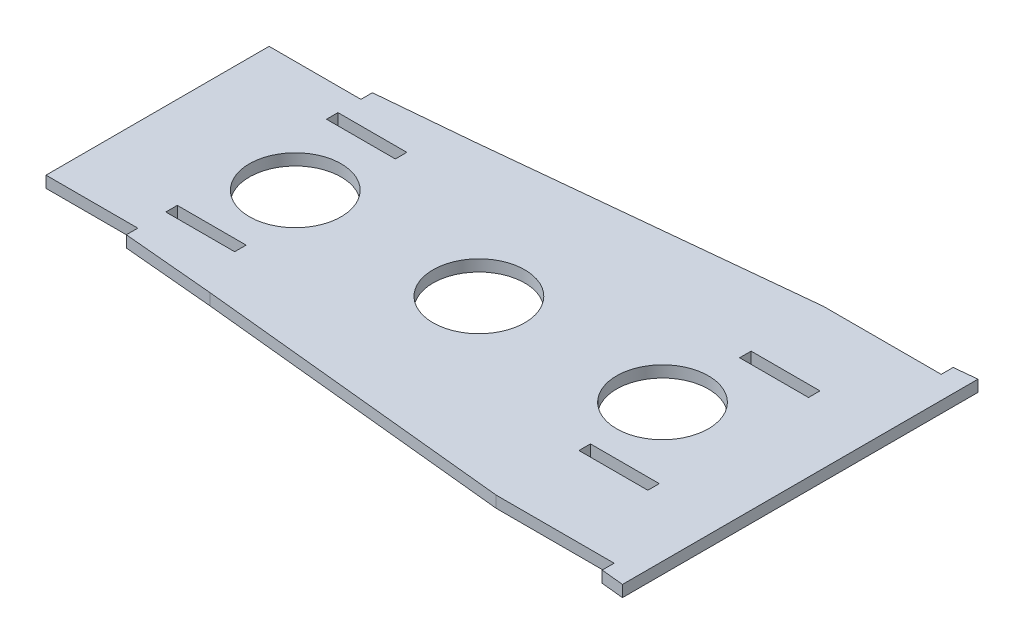
ISO-10303-21;
HEADER;
FILE_DESCRIPTION(('STEP AP214'),'2;1');
FILE_NAME('part.step','',(''),(''),'','','');
FILE_SCHEMA(('AUTOMOTIVE_DESIGN { 1 0 10303 214 1 1 1 1 }'));
ENDSEC;
DATA;
#1=APPLICATION_CONTEXT('core data for automotive mechanical design processes');
#2=APPLICATION_PROTOCOL_DEFINITION('international standard','automotive_design',2000,#1);
#3=PRODUCT_CONTEXT('',#1,'mechanical');
#4=PRODUCT('Part','Part','',(#3));
#5=PRODUCT_RELATED_PRODUCT_CATEGORY('part','',(#4));
#6=PRODUCT_DEFINITION_FORMATION('','',#4);
#7=PRODUCT_DEFINITION_CONTEXT('part definition',#1,'design');
#8=PRODUCT_DEFINITION('design','',#6,#7);
#9=PRODUCT_DEFINITION_SHAPE('','',#8);
#10=(LENGTH_UNIT() NAMED_UNIT(*) SI_UNIT(.MILLI.,.METRE.));
#11=(NAMED_UNIT(*) PLANE_ANGLE_UNIT() SI_UNIT($,.RADIAN.));
#12=(NAMED_UNIT(*) SI_UNIT($,.STERADIAN.) SOLID_ANGLE_UNIT());
#13=UNCERTAINTY_MEASURE_WITH_UNIT(LENGTH_MEASURE(1.E-05),#10,'distance_accuracy_value','');
#14=(GEOMETRIC_REPRESENTATION_CONTEXT(3) GLOBAL_UNCERTAINTY_ASSIGNED_CONTEXT((#13)) GLOBAL_UNIT_ASSIGNED_CONTEXT((#10,
#11,#12)) REPRESENTATION_CONTEXT('',''));
#15=CARTESIAN_POINT('',(0.,0.,0.));
#16=DIRECTION('',(0.,0.,1.));
#17=DIRECTION('',(1.,0.,0.));
#18=AXIS2_PLACEMENT_3D('',#15,#16,#17);
#19=CARTESIAN_POINT('',(25.4,-19.3127710336968,23.1142030780968));
#20=DIRECTION('',(0.,0.,1.));
#21=DIRECTION('',(1.,0.,0.));
#22=AXIS2_PLACEMENT_3D('',#19,#20,#21);
#23=PLANE('',#22);
#24=DIRECTION('',(-1.,0.,0.));
#25=VECTOR('',#24,1.);
#26=CARTESIAN_POINT('',(25.4,0.,23.1142030780968));
#27=LINE('',#26,#25);
#28=CARTESIAN_POINT('',(44.45,0.,23.1142030780968));
#29=VERTEX_POINT('',#28);
#30=CARTESIAN_POINT('',(25.4,0.,23.1142030780968));
#31=VERTEX_POINT('',#30);
#32=EDGE_CURVE('E473',#29,#31,#27,.T.);
#33=ORIENTED_EDGE('',*,*,#32,.T.);
#34=DIRECTION('',(0.,1.,0.));
#35=VECTOR('',#34,1.);
#36=CARTESIAN_POINT('',(25.4,-19.3127710336968,23.1142030780968));
#37=LINE('',#36,#35);
#38=CARTESIAN_POINT('',(25.4,3.175,23.1142030780968));
#39=VERTEX_POINT('',#38);
#40=EDGE_CURVE('E491',#31,#39,#37,.T.);
#41=ORIENTED_EDGE('',*,*,#40,.T.);
#42=DIRECTION('',(1.,0.,0.));
#43=VECTOR('',#42,1.);
#44=CARTESIAN_POINT('',(25.4,3.175,23.1142030780968));
#45=LINE('',#44,#43);
#46=CARTESIAN_POINT('',(44.45,3.175,23.1142030780968));
#47=VERTEX_POINT('',#46);
#48=EDGE_CURVE('E487',#39,#47,#45,.T.);
#49=ORIENTED_EDGE('',*,*,#48,.T.);
#50=DIRECTION('',(0.,1.,0.));
#51=VECTOR('',#50,1.);
#52=CARTESIAN_POINT('',(44.45,-19.3127710336968,23.1142030780968));
#53=LINE('',#52,#51);
#54=EDGE_CURVE('E11',#29,#47,#53,.T.);
#55=ORIENTED_EDGE('',*,*,#54,.F.);
#56=EDGE_LOOP('',(#33,#41,#49,#55));
#57=FACE_BOUND('',#56,.T.);
#58=ADVANCED_FACE('F49',(#57),#23,.F.);
#59=CARTESIAN_POINT('',(44.45,-19.3127710336968,19.9392030780968));
#60=DIRECTION('',(1.,0.,0.));
#61=DIRECTION('',(0.,0.,-1.));
#62=AXIS2_PLACEMENT_3D('',#59,#60,#61);
#63=PLANE('',#62);
#64=DIRECTION('',(0.,0.,1.));
#65=VECTOR('',#64,1.);
#66=CARTESIAN_POINT('',(44.45,0.,19.9392030780968));
#67=LINE('',#66,#65);
#68=CARTESIAN_POINT('',(44.45,0.,19.9392030780968));
#69=VERTEX_POINT('',#68);
#70=EDGE_CURVE('E476',#69,#29,#67,.T.);
#71=ORIENTED_EDGE('',*,*,#70,.T.);
#72=ORIENTED_EDGE('',*,*,#54,.T.);
#73=DIRECTION('',(0.,0.,-1.));
#74=VECTOR('',#73,1.);
#75=CARTESIAN_POINT('',(44.45,3.175,19.9392030780968));
#76=LINE('',#75,#74);
#77=CARTESIAN_POINT('',(44.45,3.175,19.9392030780968));
#78=VERTEX_POINT('',#77);
#79=EDGE_CURVE('E70',#47,#78,#76,.T.);
#80=ORIENTED_EDGE('',*,*,#79,.T.);
#81=DIRECTION('',(0.,1.,0.));
#82=VECTOR('',#81,1.);
#83=CARTESIAN_POINT('',(44.45,-19.3127710336968,19.9392030780968));
#84=LINE('',#83,#82);
#85=EDGE_CURVE('E56',#69,#78,#84,.T.);
#86=ORIENTED_EDGE('',*,*,#85,.F.);
#87=EDGE_LOOP('',(#71,#72,#80,#86));
#88=FACE_BOUND('',#87,.T.);
#89=ADVANCED_FACE('F500',(#88),#63,.F.);
#90=CARTESIAN_POINT('',(25.4,-19.3127710336968,19.9392030780968));
#91=DIRECTION('',(0.,0.,-1.));
#92=DIRECTION('',(-1.,0.,0.));
#93=AXIS2_PLACEMENT_3D('',#90,#91,#92);
#94=PLANE('',#93);
#95=DIRECTION('',(1.,0.,0.));
#96=VECTOR('',#95,1.);
#97=CARTESIAN_POINT('',(25.4,0.,19.9392030780968));
#98=LINE('',#97,#96);
#99=CARTESIAN_POINT('',(25.4,0.,19.9392030780968));
#100=VERTEX_POINT('',#99);
#101=EDGE_CURVE('E479',#100,#69,#98,.T.);
#102=ORIENTED_EDGE('',*,*,#101,.T.);
#103=ORIENTED_EDGE('',*,*,#85,.T.);
#104=DIRECTION('',(-1.,0.,0.));
#105=VECTOR('',#104,1.);
#106=CARTESIAN_POINT('',(25.4,3.175,19.9392030780968));
#107=LINE('',#106,#105);
#108=CARTESIAN_POINT('',(25.4,3.175,19.9392030780968));
#109=VERTEX_POINT('',#108);
#110=EDGE_CURVE('E483',#78,#109,#107,.T.);
#111=ORIENTED_EDGE('',*,*,#110,.T.);
#112=DIRECTION('',(0.,1.,0.));
#113=VECTOR('',#112,1.);
#114=CARTESIAN_POINT('',(25.4,-19.3127710336968,19.9392030780968));
#115=LINE('',#114,#113);
#116=EDGE_CURVE('E489',#100,#109,#115,.T.);
#117=ORIENTED_EDGE('',*,*,#116,.F.);
#118=EDGE_LOOP('',(#102,#103,#111,#117));
#119=FACE_BOUND('',#118,.T.);
#120=ADVANCED_FACE('F496',(#119),#94,.F.);
#121=CARTESIAN_POINT('',(25.4,-19.3127710336968,19.9392030780968));
#122=DIRECTION('',(-1.,0.,0.));
#123=DIRECTION('',(0.,0.,1.));
#124=AXIS2_PLACEMENT_3D('',#121,#122,#123);
#125=PLANE('',#124);
#126=DIRECTION('',(0.,0.,-1.));
#127=VECTOR('',#126,1.);
#128=CARTESIAN_POINT('',(25.4,0.,19.9392030780968));
#129=LINE('',#128,#127);
#130=EDGE_CURVE('E471',#31,#100,#129,.T.);
#131=ORIENTED_EDGE('',*,*,#130,.T.);
#132=ORIENTED_EDGE('',*,*,#116,.T.);
#133=DIRECTION('',(0.,0.,1.));
#134=VECTOR('',#133,1.);
#135=CARTESIAN_POINT('',(25.4,3.175,19.9392030780968));
#136=LINE('',#135,#134);
#137=EDGE_CURVE('E63',#109,#39,#136,.T.);
#138=ORIENTED_EDGE('',*,*,#137,.T.);
#139=ORIENTED_EDGE('',*,*,#40,.F.);
#140=EDGE_LOOP('',(#131,#132,#138,#139));
#141=FACE_BOUND('',#140,.T.);
#142=ADVANCED_FACE('F530',(#141),#125,.F.);
#143=CARTESIAN_POINT('',(-88.9,-19.3127710336968,23.1142030780968));
#144=DIRECTION('',(0.,0.,1.));
#145=DIRECTION('',(1.,0.,0.));
#146=AXIS2_PLACEMENT_3D('',#143,#144,#145);
#147=PLANE('',#146);
#148=DIRECTION('',(-1.,0.,0.));
#149=VECTOR('',#148,1.);
#150=CARTESIAN_POINT('',(-88.9,0.,23.1142030780968));
#151=LINE('',#150,#149);
#152=CARTESIAN_POINT('',(-69.85,0.,23.1142030780968));
#153=VERTEX_POINT('',#152);
#154=CARTESIAN_POINT('',(-88.9,0.,23.1142030780968));
#155=VERTEX_POINT('',#154);
#156=EDGE_CURVE('E439',#153,#155,#151,.T.);
#157=ORIENTED_EDGE('',*,*,#156,.T.);
#158=DIRECTION('',(0.,1.,0.));
#159=VECTOR('',#158,1.);
#160=CARTESIAN_POINT('',(-88.9,-19.3127710336968,23.1142030780968));
#161=LINE('',#160,#159);
#162=CARTESIAN_POINT('',(-88.9,3.175,23.1142030780968));
#163=VERTEX_POINT('',#162);
#164=EDGE_CURVE('E462',#155,#163,#161,.T.);
#165=ORIENTED_EDGE('',*,*,#164,.T.);
#166=DIRECTION('',(1.,0.,0.));
#167=VECTOR('',#166,1.);
#168=CARTESIAN_POINT('',(-88.9,3.175,23.1142030780968));
#169=LINE('',#168,#167);
#170=CARTESIAN_POINT('',(-69.85,3.175,23.1142030780968));
#171=VERTEX_POINT('',#170);
#172=EDGE_CURVE('E456',#163,#171,#169,.T.);
#173=ORIENTED_EDGE('',*,*,#172,.T.);
#174=DIRECTION('',(0.,1.,0.));
#175=VECTOR('',#174,1.);
#176=CARTESIAN_POINT('',(-69.85,-19.3127710336968,23.1142030780968));
#177=LINE('',#176,#175);
#178=EDGE_CURVE('E468',#153,#171,#177,.T.);
#179=ORIENTED_EDGE('',*,*,#178,.F.);
#180=EDGE_LOOP('',(#157,#165,#173,#179));
#181=FACE_BOUND('',#180,.T.);
#182=ADVANCED_FACE('F535',(#181),#147,.F.);
#183=CARTESIAN_POINT('',(-69.85,-19.3127710336968,19.9392030780968));
#184=DIRECTION('',(1.,0.,0.));
#185=DIRECTION('',(0.,0.,-1.));
#186=AXIS2_PLACEMENT_3D('',#183,#184,#185);
#187=PLANE('',#186);
#188=DIRECTION('',(0.,0.,1.));
#189=VECTOR('',#188,1.);
#190=CARTESIAN_POINT('',(-69.85,0.,19.9392030780968));
#191=LINE('',#190,#189);
#192=CARTESIAN_POINT('',(-69.85,0.,19.9392030780968));
#193=VERTEX_POINT('',#192);
#194=EDGE_CURVE('E442',#193,#153,#191,.T.);
#195=ORIENTED_EDGE('',*,*,#194,.T.);
#196=ORIENTED_EDGE('',*,*,#178,.T.);
#197=DIRECTION('',(0.,0.,-1.));
#198=VECTOR('',#197,1.);
#199=CARTESIAN_POINT('',(-69.85,3.175,19.9392030780968));
#200=LINE('',#199,#198);
#201=CARTESIAN_POINT('',(-69.85,3.175,19.9392030780968));
#202=VERTEX_POINT('',#201);
#203=EDGE_CURVE('E453',#171,#202,#200,.T.);
#204=ORIENTED_EDGE('',*,*,#203,.T.);
#205=DIRECTION('',(0.,1.,0.));
#206=VECTOR('',#205,1.);
#207=CARTESIAN_POINT('',(-69.85,-19.3127710336968,19.9392030780968));
#208=LINE('',#207,#206);
#209=EDGE_CURVE('E465',#193,#202,#208,.T.);
#210=ORIENTED_EDGE('',*,*,#209,.F.);
#211=EDGE_LOOP('',(#195,#196,#204,#210));
#212=FACE_BOUND('',#211,.T.);
#213=ADVANCED_FACE('F538',(#212),#187,.F.);
#214=CARTESIAN_POINT('',(-88.9,-19.3127710336968,19.9392030780968));
#215=DIRECTION('',(0.,0.,-1.));
#216=DIRECTION('',(-1.,0.,0.));
#217=AXIS2_PLACEMENT_3D('',#214,#215,#216);
#218=PLANE('',#217);
#219=DIRECTION('',(1.,0.,0.));
#220=VECTOR('',#219,1.);
#221=CARTESIAN_POINT('',(-88.9,0.,19.9392030780968));
#222=LINE('',#221,#220);
#223=CARTESIAN_POINT('',(-88.9,0.,19.9392030780968));
#224=VERTEX_POINT('',#223);
#225=EDGE_CURVE('E445',#224,#193,#222,.T.);
#226=ORIENTED_EDGE('',*,*,#225,.T.);
#227=ORIENTED_EDGE('',*,*,#209,.T.);
#228=DIRECTION('',(-1.,0.,0.));
#229=VECTOR('',#228,1.);
#230=CARTESIAN_POINT('',(-88.9,3.175,19.9392030780968));
#231=LINE('',#230,#229);
#232=CARTESIAN_POINT('',(-88.9,3.175,19.9392030780968));
#233=VERTEX_POINT('',#232);
#234=EDGE_CURVE('E450',#202,#233,#231,.T.);
#235=ORIENTED_EDGE('',*,*,#234,.T.);
#236=DIRECTION('',(0.,1.,0.));
#237=VECTOR('',#236,1.);
#238=CARTESIAN_POINT('',(-88.9,-19.3127710336968,19.9392030780968));
#239=LINE('',#238,#237);
#240=EDGE_CURVE('E459',#224,#233,#239,.T.);
#241=ORIENTED_EDGE('',*,*,#240,.F.);
#242=EDGE_LOOP('',(#226,#227,#235,#241));
#243=FACE_BOUND('',#242,.T.);
#244=ADVANCED_FACE('F542',(#243),#218,.F.);
#245=CARTESIAN_POINT('',(-88.9,-19.3127710336968,19.9392030780968));
#246=DIRECTION('',(-1.,0.,0.));
#247=DIRECTION('',(0.,0.,1.));
#248=AXIS2_PLACEMENT_3D('',#245,#246,#247);
#249=PLANE('',#248);
#250=DIRECTION('',(0.,0.,-1.));
#251=VECTOR('',#250,1.);
#252=CARTESIAN_POINT('',(-88.9,0.,19.9392030780968));
#253=LINE('',#252,#251);
#254=EDGE_CURVE('E437',#155,#224,#253,.T.);
#255=ORIENTED_EDGE('',*,*,#254,.T.);
#256=ORIENTED_EDGE('',*,*,#240,.T.);
#257=DIRECTION('',(0.,0.,1.));
#258=VECTOR('',#257,1.);
#259=CARTESIAN_POINT('',(-88.9,3.175,19.9392030780968));
#260=LINE('',#259,#258);
#261=EDGE_CURVE('E448',#233,#163,#260,.T.);
#262=ORIENTED_EDGE('',*,*,#261,.T.);
#263=ORIENTED_EDGE('',*,*,#164,.F.);
#264=EDGE_LOOP('',(#255,#256,#262,#263));
#265=FACE_BOUND('',#264,.T.);
#266=ADVANCED_FACE('F546',(#265),#249,.F.);
#267=CARTESIAN_POINT('',(0.,3.175,30.8607969219032));
#268=DIRECTION('',(0.,0.,-1.));
#269=DIRECTION('',(-1.,0.,0.));
#270=AXIS2_PLACEMENT_3D('',#267,#268,#269);
#271=PLANE('',#270);
#272=DIRECTION('',(1.,0.,0.));
#273=VECTOR('',#272,1.);
#274=CARTESIAN_POINT('',(0.,0.,30.8607969219032));
#275=LINE('',#274,#273);
#276=CARTESIAN_POINT('',(-114.3,0.,30.8607969219032));
#277=VERTEX_POINT('',#276);
#278=CARTESIAN_POINT('',(-88.9,0.,30.8607969219032));
#279=VERTEX_POINT('',#278);
#280=EDGE_CURVE('E321',#277,#279,#275,.T.);
#281=ORIENTED_EDGE('',*,*,#280,.T.);
#282=DIRECTION('',(0.,-1.,0.));
#283=VECTOR('',#282,1.);
#284=CARTESIAN_POINT('',(-88.9,3.175,30.8607969219032));
#285=LINE('',#284,#283);
#286=CARTESIAN_POINT('',(-88.9,3.175,30.8607969219032));
#287=VERTEX_POINT('',#286);
#288=EDGE_CURVE('E434',#287,#279,#285,.T.);
#289=ORIENTED_EDGE('',*,*,#288,.F.);
#290=DIRECTION('',(1.,0.,0.));
#291=VECTOR('',#290,1.);
#292=CARTESIAN_POINT('',(0.,3.175,30.8607969219032));
#293=LINE('',#292,#291);
#294=CARTESIAN_POINT('',(-114.3,3.175,30.8607969219032));
#295=VERTEX_POINT('',#294);
#296=EDGE_CURVE('E322',#295,#287,#293,.T.);
#297=ORIENTED_EDGE('',*,*,#296,.F.);
#298=DIRECTION('',(0.,-1.,0.));
#299=VECTOR('',#298,1.);
#300=CARTESIAN_POINT('',(-114.3,3.175,30.8607969219032));
#301=LINE('',#300,#299);
#302=EDGE_CURVE('E361',#295,#277,#301,.T.);
#303=ORIENTED_EDGE('',*,*,#302,.T.);
#304=EDGE_LOOP('',(#281,#289,#297,#303));
#305=FACE_BOUND('',#304,.T.);
#306=ADVANCED_FACE('F550',(#305),#271,.F.);
#307=CARTESIAN_POINT('',(-88.9,3.175,0.));
#308=DIRECTION('',(1.,0.,0.));
#309=DIRECTION('',(0.,0.,-1.));
#310=AXIS2_PLACEMENT_3D('',#307,#308,#309);
#311=PLANE('',#310);
#312=DIRECTION('',(0.,0.,1.));
#313=VECTOR('',#312,1.);
#314=CARTESIAN_POINT('',(-88.9,0.,0.));
#315=LINE('',#314,#313);
#316=CARTESIAN_POINT('',(-88.9,0.,34.0357969219032));
#317=VERTEX_POINT('',#316);
#318=EDGE_CURVE('E364',#279,#317,#315,.T.);
#319=ORIENTED_EDGE('',*,*,#318,.T.);
#320=DIRECTION('',(0.,-1.,0.));
#321=VECTOR('',#320,1.);
#322=CARTESIAN_POINT('',(-88.9,3.175,34.0357969219032));
#323=LINE('',#322,#321);
#324=CARTESIAN_POINT('',(-88.9,3.175,34.0357969219032));
#325=VERTEX_POINT('',#324);
#326=EDGE_CURVE('E431',#325,#317,#323,.T.);
#327=ORIENTED_EDGE('',*,*,#326,.F.);
#328=DIRECTION('',(0.,0.,1.));
#329=VECTOR('',#328,1.);
#330=CARTESIAN_POINT('',(-88.9,3.175,0.));
#331=LINE('',#330,#329);
#332=EDGE_CURVE('E325',#287,#325,#331,.T.);
#333=ORIENTED_EDGE('',*,*,#332,.F.);
#334=ORIENTED_EDGE('',*,*,#288,.T.);
#335=EDGE_LOOP('',(#319,#327,#333,#334));
#336=FACE_BOUND('',#335,.T.);
#337=ADVANCED_FACE('F554',(#336),#311,.F.);
#338=CARTESIAN_POINT('',(-3.75252164128227,3.175,41.6983892030127));
#339=DIRECTION('',(0.0896298004541128,0.,-0.995975149725411));
#340=DIRECTION('',(-0.995975149725412,0.,-0.0896298004541128));
#341=AXIS2_PLACEMENT_3D('',#338,#339,#340);
#342=PLANE('',#341);
#343=DIRECTION('',(0.995975149725412,0.,0.0896298004541128));
#344=VECTOR('',#343,1.);
#345=CARTESIAN_POINT('',(-3.75252164128227,0.,41.6983892030127));
#346=LINE('',#345,#344);
#347=CARTESIAN_POINT('',(-63.5,0.,36.3215938438065));
#348=VERTEX_POINT('',#347);
#349=EDGE_CURVE('E366',#317,#348,#346,.T.);
#350=ORIENTED_EDGE('',*,*,#349,.T.);
#351=DIRECTION('',(0.,-1.,0.));
#352=VECTOR('',#351,1.);
#353=CARTESIAN_POINT('',(-63.5,3.175,36.3215938438065));
#354=LINE('',#353,#352);
#355=CARTESIAN_POINT('',(-63.5,3.175,36.3215938438065));
#356=VERTEX_POINT('',#355);
#357=EDGE_CURVE('E428',#356,#348,#354,.T.);
#358=ORIENTED_EDGE('',*,*,#357,.F.);
#359=DIRECTION('',(0.995975149725412,0.,0.0896298004541128));
#360=VECTOR('',#359,1.);
#361=CARTESIAN_POINT('',(-3.75252164128227,3.175,41.6983892030127));
#362=LINE('',#361,#360);
#363=EDGE_CURVE('E328',#325,#356,#362,.T.);
#364=ORIENTED_EDGE('',*,*,#363,.F.);
#365=ORIENTED_EDGE('',*,*,#326,.T.);
#366=EDGE_LOOP('',(#350,#358,#364,#365));
#367=FACE_BOUND('',#366,.T.);
#368=ADVANCED_FACE('F558',(#367),#342,.F.);
#369=CARTESIAN_POINT('',(-4.28476457205807,3.175,42.3173258059613));
#370=DIRECTION('',(0.100738120693932,0.,-0.994912976616073));
#371=DIRECTION('',(-0.994912976616073,0.,-0.100738120693932));
#372=AXIS2_PLACEMENT_3D('',#369,#370,#371);
#373=PLANE('',#372);
#374=DIRECTION('',(0.994912976616073,0.,0.100738120693932));
#375=VECTOR('',#374,1.);
#376=CARTESIAN_POINT('',(-4.28476457205807,0.,42.3173258059613));
#377=LINE('',#376,#375);
#378=CARTESIAN_POINT('',(24.6454443556202,0.,45.246601981019));
#379=VERTEX_POINT('',#378);
#380=EDGE_CURVE('E368',#348,#379,#377,.T.);
#381=ORIENTED_EDGE('',*,*,#380,.T.);
#382=DIRECTION('',(0.,-1.,0.));
#383=VECTOR('',#382,1.);
#384=CARTESIAN_POINT('',(24.6454443556202,3.175,45.246601981019));
#385=LINE('',#384,#383);
#386=CARTESIAN_POINT('',(24.6454443556202,3.175,45.246601981019));
#387=VERTEX_POINT('',#386);
#388=EDGE_CURVE('E425',#387,#379,#385,.T.);
#389=ORIENTED_EDGE('',*,*,#388,.F.);
#390=DIRECTION('',(0.994912976616073,0.,0.100738120693932));
#391=VECTOR('',#390,1.);
#392=CARTESIAN_POINT('',(-4.28476457205807,3.175,42.3173258059613));
#393=LINE('',#392,#391);
#394=EDGE_CURVE('E330',#356,#387,#393,.T.);
#395=ORIENTED_EDGE('',*,*,#394,.F.);
#396=ORIENTED_EDGE('',*,*,#357,.T.);
#397=EDGE_LOOP('',(#381,#389,#395,#396));
#398=FACE_BOUND('',#397,.T.);
#399=ADVANCED_FACE('F562',(#398),#373,.F.);
#400=CARTESIAN_POINT('',(0.,3.175,45.246601981019));
#401=DIRECTION('',(0.,0.,-1.));
#402=DIRECTION('',(-1.,0.,0.));
#403=AXIS2_PLACEMENT_3D('',#400,#401,#402);
#404=PLANE('',#403);
#405=DIRECTION('',(1.,0.,0.));
#406=VECTOR('',#405,1.);
#407=CARTESIAN_POINT('',(0.,0.,45.246601981019));
#408=LINE('',#407,#406);
#409=CARTESIAN_POINT('',(57.2567599743374,0.,45.246601981019));
#410=VERTEX_POINT('',#409);
#411=EDGE_CURVE('E370',#379,#410,#408,.T.);
#412=ORIENTED_EDGE('',*,*,#411,.T.);
#413=DIRECTION('',(0.,-1.,0.));
#414=VECTOR('',#413,1.);
#415=CARTESIAN_POINT('',(57.2567599743374,3.175,45.246601981019));
#416=LINE('',#415,#414);
#417=CARTESIAN_POINT('',(57.2567599743374,3.175,45.246601981019));
#418=VERTEX_POINT('',#417);
#419=EDGE_CURVE('E422',#418,#410,#416,.T.);
#420=ORIENTED_EDGE('',*,*,#419,.F.);
#421=DIRECTION('',(1.,0.,0.));
#422=VECTOR('',#421,1.);
#423=CARTESIAN_POINT('',(0.,3.175,45.246601981019));
#424=LINE('',#423,#422);
#425=EDGE_CURVE('E332',#387,#418,#424,.T.);
#426=ORIENTED_EDGE('',*,*,#425,.F.);
#427=ORIENTED_EDGE('',*,*,#388,.T.);
#428=EDGE_LOOP('',(#412,#420,#426,#427));
#429=FACE_BOUND('',#428,.T.);
#430=ADVANCED_FACE('F564',(#429),#404,.F.);
#431=CARTESIAN_POINT('',(57.2567599743374,3.175,0.));
#432=DIRECTION('',(1.,0.,0.));
#433=DIRECTION('',(0.,0.,-1.));
#434=AXIS2_PLACEMENT_3D('',#431,#432,#433);
#435=PLANE('',#434);
#436=DIRECTION('',(0.,0.,1.));
#437=VECTOR('',#436,1.);
#438=CARTESIAN_POINT('',(57.2567599743374,0.,0.));
#439=LINE('',#438,#437);
#440=CARTESIAN_POINT('',(57.2567599743374,0.,48.548601981019));
#441=VERTEX_POINT('',#440);
#442=EDGE_CURVE('E373',#410,#441,#439,.T.);
#443=ORIENTED_EDGE('',*,*,#442,.T.);
#444=DIRECTION('',(0.,-1.,0.));
#445=VECTOR('',#444,1.);
#446=CARTESIAN_POINT('',(57.2567599743374,3.175,48.548601981019));
#447=LINE('',#446,#445);
#448=CARTESIAN_POINT('',(57.2567599743374,3.175,48.548601981019));
#449=VERTEX_POINT('',#448);
#450=EDGE_CURVE('E419',#449,#441,#447,.T.);
#451=ORIENTED_EDGE('',*,*,#450,.F.);
#452=DIRECTION('',(0.,0.,1.));
#453=VECTOR('',#452,1.);
#454=CARTESIAN_POINT('',(57.2567599743374,3.175,0.));
#455=LINE('',#454,#453);
#456=EDGE_CURVE('E335',#418,#449,#455,.T.);
#457=ORIENTED_EDGE('',*,*,#456,.F.);
#458=ORIENTED_EDGE('',*,*,#419,.T.);
#459=EDGE_LOOP('',(#443,#451,#457,#458));
#460=FACE_BOUND('',#459,.T.);
#461=ADVANCED_FACE('F567',(#460),#435,.F.);
#462=CARTESIAN_POINT('',(63.5,0.,49.18075));
#463=VERTEX_POINT('',#462);
#464=EDGE_CURVE('E371',#441,#463,#377,.T.);
#465=ORIENTED_EDGE('',*,*,#464,.T.);
#466=DIRECTION('',(0.,-1.,0.));
#467=VECTOR('',#466,1.);
#468=CARTESIAN_POINT('',(63.5,3.175,49.18075));
#469=LINE('',#468,#467);
#470=CARTESIAN_POINT('',(63.5,3.175,49.18075));
#471=VERTEX_POINT('',#470);
#472=EDGE_CURVE('E416',#471,#463,#469,.T.);
#473=ORIENTED_EDGE('',*,*,#472,.F.);
#474=EDGE_CURVE('E333',#449,#471,#393,.T.);
#475=ORIENTED_EDGE('',*,*,#474,.F.);
#476=ORIENTED_EDGE('',*,*,#450,.T.);
#477=EDGE_LOOP('',(#465,#473,#475,#476));
#478=FACE_BOUND('',#477,.T.);
#479=ADVANCED_FACE('F571',(#478),#373,.F.);
#480=CARTESIAN_POINT('',(63.5,3.175,0.));
#481=DIRECTION('',(-1.,0.,0.));
#482=DIRECTION('',(0.,0.,1.));
#483=AXIS2_PLACEMENT_3D('',#480,#481,#482);
#484=PLANE('',#483);
#485=DIRECTION('',(0.,0.,-1.));
#486=VECTOR('',#485,1.);
#487=CARTESIAN_POINT('',(63.5,0.,0.));
#488=LINE('',#487,#486);
#489=CARTESIAN_POINT('',(63.5,0.,-49.18075));
#490=VERTEX_POINT('',#489);
#491=EDGE_CURVE('E375',#463,#490,#488,.T.);
#492=ORIENTED_EDGE('',*,*,#491,.T.);
#493=DIRECTION('',(0.,-1.,0.));
#494=VECTOR('',#493,1.);
#495=CARTESIAN_POINT('',(63.5,3.175,-49.18075));
#496=LINE('',#495,#494);
#497=CARTESIAN_POINT('',(63.5,3.175,-49.18075));
#498=VERTEX_POINT('',#497);
#499=EDGE_CURVE('E414',#498,#490,#496,.T.);
#500=ORIENTED_EDGE('',*,*,#499,.F.);
#501=DIRECTION('',(0.,0.,-1.));
#502=VECTOR('',#501,1.);
#503=CARTESIAN_POINT('',(63.5,3.175,0.));
#504=LINE('',#503,#502);
#505=EDGE_CURVE('E337',#471,#498,#504,.T.);
#506=ORIENTED_EDGE('',*,*,#505,.F.);
#507=ORIENTED_EDGE('',*,*,#472,.T.);
#508=EDGE_LOOP('',(#492,#500,#506,#507));
#509=FACE_BOUND('',#508,.T.);
#510=ADVANCED_FACE('F575',(#509),#484,.F.);
#511=CARTESIAN_POINT('',(-4.28476457205807,3.175,-42.3173258059613));
#512=DIRECTION('',(-0.100738120693932,0.,-0.994912976616073));
#513=DIRECTION('',(-0.994912976616073,0.,0.100738120693932));
#514=AXIS2_PLACEMENT_3D('',#511,#512,#513);
#515=PLANE('',#514);
#516=DIRECTION('',(0.994912976616073,0.,-0.100738120693932));
#517=VECTOR('',#516,1.);
#518=CARTESIAN_POINT('',(-4.28476457205807,0.,-42.3173258059613));
#519=LINE('',#518,#517);
#520=CARTESIAN_POINT('',(57.2567599743374,0.,-48.548601981019));
#521=VERTEX_POINT('',#520);
#522=EDGE_CURVE('E378',#521,#490,#519,.T.);
#523=ORIENTED_EDGE('',*,*,#522,.F.);
#524=DIRECTION('',(0.,-1.,0.));
#525=VECTOR('',#524,1.);
#526=CARTESIAN_POINT('',(57.2567599743374,3.175,-48.548601981019));
#527=LINE('',#526,#525);
#528=CARTESIAN_POINT('',(57.2567599743374,3.175,-48.548601981019));
#529=VERTEX_POINT('',#528);
#530=EDGE_CURVE('E412',#529,#521,#527,.T.);
#531=ORIENTED_EDGE('',*,*,#530,.F.);
#532=DIRECTION('',(0.994912976616073,0.,-0.100738120693932));
#533=VECTOR('',#532,1.);
#534=CARTESIAN_POINT('',(-4.28476457205807,3.175,-42.3173258059613));
#535=LINE('',#534,#533);
#536=EDGE_CURVE('E339',#529,#498,#535,.T.);
#537=ORIENTED_EDGE('',*,*,#536,.T.);
#538=ORIENTED_EDGE('',*,*,#499,.T.);
#539=EDGE_LOOP('',(#523,#531,#537,#538));
#540=FACE_BOUND('',#539,.T.);
#541=ADVANCED_FACE('F579',(#540),#515,.T.);
#542=CARTESIAN_POINT('',(57.2567599743374,3.175,0.));
#543=DIRECTION('',(-1.,0.,0.));
#544=DIRECTION('',(0.,0.,1.));
#545=AXIS2_PLACEMENT_3D('',#542,#543,#544);
#546=PLANE('',#545);
#547=DIRECTION('',(0.,0.,-1.));
#548=VECTOR('',#547,1.);
#549=CARTESIAN_POINT('',(57.2567599743374,0.,0.));
#550=LINE('',#549,#548);
#551=CARTESIAN_POINT('',(57.2567599743374,0.,-45.246601981019));
#552=VERTEX_POINT('',#551);
#553=EDGE_CURVE('E381',#552,#521,#550,.T.);
#554=ORIENTED_EDGE('',*,*,#553,.F.);
#555=DIRECTION('',(0.,-1.,0.));
#556=VECTOR('',#555,1.);
#557=CARTESIAN_POINT('',(57.2567599743374,3.175,-45.246601981019));
#558=LINE('',#557,#556);
#559=CARTESIAN_POINT('',(57.2567599743374,3.175,-45.246601981019));
#560=VERTEX_POINT('',#559);
#561=EDGE_CURVE('E410',#560,#552,#558,.T.);
#562=ORIENTED_EDGE('',*,*,#561,.F.);
#563=DIRECTION('',(0.,0.,-1.));
#564=VECTOR('',#563,1.);
#565=CARTESIAN_POINT('',(57.2567599743374,3.175,0.));
#566=LINE('',#565,#564);
#567=EDGE_CURVE('E342',#560,#529,#566,.T.);
#568=ORIENTED_EDGE('',*,*,#567,.T.);
#569=ORIENTED_EDGE('',*,*,#530,.T.);
#570=EDGE_LOOP('',(#554,#562,#568,#569));
#571=FACE_BOUND('',#570,.T.);
#572=ADVANCED_FACE('F581',(#571),#546,.T.);
#573=CARTESIAN_POINT('',(0.,3.175,-45.246601981019));
#574=DIRECTION('',(0.,0.,-1.));
#575=DIRECTION('',(-1.,0.,0.));
#576=AXIS2_PLACEMENT_3D('',#573,#574,#575);
#577=PLANE('',#576);
#578=DIRECTION('',(1.,0.,0.));
#579=VECTOR('',#578,1.);
#580=CARTESIAN_POINT('',(0.,0.,-45.246601981019));
#581=LINE('',#580,#579);
#582=CARTESIAN_POINT('',(24.6454443556202,0.,-45.246601981019));
#583=VERTEX_POINT('',#582);
#584=EDGE_CURVE('E385',#583,#552,#581,.T.);
#585=ORIENTED_EDGE('',*,*,#584,.F.);
#586=DIRECTION('',(0.,-1.,0.));
#587=VECTOR('',#586,1.);
#588=CARTESIAN_POINT('',(24.6454443556202,3.175,-45.246601981019));
#589=LINE('',#588,#587);
#590=CARTESIAN_POINT('',(24.6454443556202,3.175,-45.246601981019));
#591=VERTEX_POINT('',#590);
#592=EDGE_CURVE('E408',#591,#583,#589,.T.);
#593=ORIENTED_EDGE('',*,*,#592,.F.);
#594=DIRECTION('',(1.,0.,0.));
#595=VECTOR('',#594,1.);
#596=CARTESIAN_POINT('',(0.,3.175,-45.246601981019));
#597=LINE('',#596,#595);
#598=EDGE_CURVE('E346',#591,#560,#597,.T.);
#599=ORIENTED_EDGE('',*,*,#598,.T.);
#600=ORIENTED_EDGE('',*,*,#561,.T.);
#601=EDGE_LOOP('',(#585,#593,#599,#600));
#602=FACE_BOUND('',#601,.T.);
#603=ADVANCED_FACE('F584',(#602),#577,.T.);
#604=CARTESIAN_POINT('',(-63.5,0.,-36.3215938438065));
#605=VERTEX_POINT('',#604);
#606=EDGE_CURVE('E382',#605,#583,#519,.T.);
#607=ORIENTED_EDGE('',*,*,#606,.F.);
#608=DIRECTION('',(0.,-1.,0.));
#609=VECTOR('',#608,1.);
#610=CARTESIAN_POINT('',(-63.5,3.175,-36.3215938438065));
#611=LINE('',#610,#609);
#612=CARTESIAN_POINT('',(-63.5,3.175,-36.3215938438065));
#613=VERTEX_POINT('',#612);
#614=EDGE_CURVE('E406',#613,#605,#611,.T.);
#615=ORIENTED_EDGE('',*,*,#614,.F.);
#616=EDGE_CURVE('E343',#613,#591,#535,.T.);
#617=ORIENTED_EDGE('',*,*,#616,.T.);
#618=ORIENTED_EDGE('',*,*,#592,.T.);
#619=EDGE_LOOP('',(#607,#615,#617,#618));
#620=FACE_BOUND('',#619,.T.);
#621=ADVANCED_FACE('F588',(#620),#515,.T.);
#622=CARTESIAN_POINT('',(-3.75252164128227,3.175,-41.6983892030127));
#623=DIRECTION('',(-0.0896298004541128,0.,-0.995975149725411));
#624=DIRECTION('',(-0.995975149725412,0.,0.0896298004541128));
#625=AXIS2_PLACEMENT_3D('',#622,#623,#624);
#626=PLANE('',#625);
#627=DIRECTION('',(0.995975149725412,0.,-0.0896298004541128));
#628=VECTOR('',#627,1.);
#629=CARTESIAN_POINT('',(-3.75252164128227,0.,-41.6983892030127));
#630=LINE('',#629,#628);
#631=CARTESIAN_POINT('',(-88.9,0.,-34.0357969219032));
#632=VERTEX_POINT('',#631);
#633=EDGE_CURVE('E388',#632,#605,#630,.T.);
#634=ORIENTED_EDGE('',*,*,#633,.F.);
#635=DIRECTION('',(0.,-1.,0.));
#636=VECTOR('',#635,1.);
#637=CARTESIAN_POINT('',(-88.9,3.175,-34.0357969219032));
#638=LINE('',#637,#636);
#639=CARTESIAN_POINT('',(-88.9,3.175,-34.0357969219032));
#640=VERTEX_POINT('',#639);
#641=EDGE_CURVE('E404',#640,#632,#638,.T.);
#642=ORIENTED_EDGE('',*,*,#641,.F.);
#643=DIRECTION('',(0.995975149725412,0.,-0.0896298004541128));
#644=VECTOR('',#643,1.);
#645=CARTESIAN_POINT('',(-3.75252164128227,3.175,-41.6983892030127));
#646=LINE('',#645,#644);
#647=EDGE_CURVE('E349',#640,#613,#646,.T.);
#648=ORIENTED_EDGE('',*,*,#647,.T.);
#649=ORIENTED_EDGE('',*,*,#614,.T.);
#650=EDGE_LOOP('',(#634,#642,#648,#649));
#651=FACE_BOUND('',#650,.T.);
#652=ADVANCED_FACE('F592',(#651),#626,.T.);
#653=CARTESIAN_POINT('',(-88.8999999999998,3.175,3.88578058618804E-13));
#654=DIRECTION('',(-1.,0.,0.));
#655=DIRECTION('',(0.,0.,1.));
#656=AXIS2_PLACEMENT_3D('',#653,#654,#655);
#657=PLANE('',#656);
#658=DIRECTION('',(0.,0.,-1.));
#659=VECTOR('',#658,1.);
#660=CARTESIAN_POINT('',(-88.8999999999998,0.,3.88578058618804E-13));
#661=LINE('',#660,#659);
#662=CARTESIAN_POINT('',(-88.9,0.,-30.8607969219032));
#663=VERTEX_POINT('',#662);
#664=EDGE_CURVE('E391',#663,#632,#661,.T.);
#665=ORIENTED_EDGE('',*,*,#664,.F.);
#666=DIRECTION('',(0.,-1.,0.));
#667=VECTOR('',#666,1.);
#668=CARTESIAN_POINT('',(-88.9,3.175,-30.8607969219032));
#669=LINE('',#668,#667);
#670=CARTESIAN_POINT('',(-88.9,3.175,-30.8607969219032));
#671=VERTEX_POINT('',#670);
#672=EDGE_CURVE('E402',#671,#663,#669,.T.);
#673=ORIENTED_EDGE('',*,*,#672,.F.);
#674=DIRECTION('',(0.,0.,-1.));
#675=VECTOR('',#674,1.);
#676=CARTESIAN_POINT('',(-88.8999999999998,3.175,3.88578058618804E-13));
#677=LINE('',#676,#675);
#678=EDGE_CURVE('E352',#671,#640,#677,.T.);
#679=ORIENTED_EDGE('',*,*,#678,.T.);
#680=ORIENTED_EDGE('',*,*,#641,.T.);
#681=EDGE_LOOP('',(#665,#673,#679,#680));
#682=FACE_BOUND('',#681,.T.);
#683=ADVANCED_FACE('F596',(#682),#657,.T.);
#684=CARTESIAN_POINT('',(0.,3.175,-30.8607969219032));
#685=DIRECTION('',(0.,0.,-1.));
#686=DIRECTION('',(-1.,0.,0.));
#687=AXIS2_PLACEMENT_3D('',#684,#685,#686);
#688=PLANE('',#687);
#689=DIRECTION('',(1.,0.,0.));
#690=VECTOR('',#689,1.);
#691=CARTESIAN_POINT('',(0.,0.,-30.8607969219032));
#692=LINE('',#691,#690);
#693=CARTESIAN_POINT('',(-114.3,0.,-30.8607969219032));
#694=VERTEX_POINT('',#693);
#695=EDGE_CURVE('E394',#694,#663,#692,.T.);
#696=ORIENTED_EDGE('',*,*,#695,.F.);
#697=DIRECTION('',(0.,-1.,0.));
#698=VECTOR('',#697,1.);
#699=CARTESIAN_POINT('',(-114.3,3.175,-30.8607969219032));
#700=LINE('',#699,#698);
#701=CARTESIAN_POINT('',(-114.3,3.175,-30.8607969219032));
#702=VERTEX_POINT('',#701);
#703=EDGE_CURVE('E400',#702,#694,#700,.T.);
#704=ORIENTED_EDGE('',*,*,#703,.F.);
#705=DIRECTION('',(1.,0.,0.));
#706=VECTOR('',#705,1.);
#707=CARTESIAN_POINT('',(0.,3.175,-30.8607969219032));
#708=LINE('',#707,#706);
#709=EDGE_CURVE('E355',#702,#671,#708,.T.);
#710=ORIENTED_EDGE('',*,*,#709,.T.);
#711=ORIENTED_EDGE('',*,*,#672,.T.);
#712=EDGE_LOOP('',(#696,#704,#710,#711));
#713=FACE_BOUND('',#712,.T.);
#714=ADVANCED_FACE('F516',(#713),#688,.T.);
#715=CARTESIAN_POINT('',(-114.3,3.175,0.));
#716=DIRECTION('',(-1.,0.,0.));
#717=DIRECTION('',(0.,0.,1.));
#718=AXIS2_PLACEMENT_3D('',#715,#716,#717);
#719=PLANE('',#718);
#720=DIRECTION('',(0.,0.,-1.));
#721=VECTOR('',#720,1.);
#722=CARTESIAN_POINT('',(-114.3,0.,0.));
#723=LINE('',#722,#721);
#724=EDGE_CURVE('E326',#277,#694,#723,.T.);
#725=ORIENTED_EDGE('',*,*,#724,.F.);
#726=ORIENTED_EDGE('',*,*,#302,.F.);
#727=DIRECTION('',(0.,0.,-1.));
#728=VECTOR('',#727,1.);
#729=CARTESIAN_POINT('',(-114.3,3.175,0.));
#730=LINE('',#729,#728);
#731=EDGE_CURVE('E358',#295,#702,#730,.T.);
#732=ORIENTED_EDGE('',*,*,#731,.T.);
#733=ORIENTED_EDGE('',*,*,#703,.T.);
#734=EDGE_LOOP('',(#725,#726,#732,#733));
#735=FACE_BOUND('',#734,.T.);
#736=ADVANCED_FACE('F505',(#735),#719,.T.);
#737=CARTESIAN_POINT('',(0.,3.175,0.));
#738=DIRECTION('',(0.,1.,0.));
#739=DIRECTION('',(0.,0.,1.));
#740=AXIS2_PLACEMENT_3D('',#737,#738,#739);
#741=PLANE('',#740);
#742=CARTESIAN_POINT('',(-76.2,3.175,0.));
#743=DIRECTION('',(0.,1.,0.));
#744=DIRECTION('',(0.,0.,1.));
#745=AXIS2_PLACEMENT_3D('',#742,#743,#744);
#746=CIRCLE('',#745,12.7);
#747=CARTESIAN_POINT('',(-76.2,3.175,12.7));
#748=VERTEX_POINT('',#747);
#749=EDGE_CURVE('E888',#748,#748,#746,.T.);
#750=ORIENTED_EDGE('',*,*,#749,.F.);
#751=EDGE_LOOP('',(#750));
#752=FACE_BOUND('',#751,.T.);
#753=CARTESIAN_POINT('',(25.4,3.175,0.));
#754=DIRECTION('',(0.,1.,0.));
#755=DIRECTION('',(0.,0.,1.));
#756=AXIS2_PLACEMENT_3D('',#753,#754,#755);
#757=CIRCLE('',#756,12.7);
#758=CARTESIAN_POINT('',(25.4,3.175,12.7));
#759=VERTEX_POINT('',#758);
#760=EDGE_CURVE('E893',#759,#759,#757,.T.);
#761=ORIENTED_EDGE('',*,*,#760,.F.);
#762=EDGE_LOOP('',(#761));
#763=FACE_BOUND('',#762,.T.);
#764=CARTESIAN_POINT('',(-25.4,3.175,0.));
#765=DIRECTION('',(0.,1.,0.));
#766=DIRECTION('',(0.,0.,1.));
#767=AXIS2_PLACEMENT_3D('',#764,#765,#766);
#768=CIRCLE('',#767,12.7);
#769=CARTESIAN_POINT('',(-25.4,3.175,12.7));
#770=VERTEX_POINT('',#769);
#771=EDGE_CURVE('E889',#770,#770,#768,.T.);
#772=ORIENTED_EDGE('',*,*,#771,.F.);
#773=EDGE_LOOP('',(#772));
#774=FACE_BOUND('',#773,.T.);
#775=DIRECTION('',(0.,0.,1.));
#776=VECTOR('',#775,1.);
#777=CARTESIAN_POINT('',(25.4,3.175,-24.5107969219032));
#778=LINE('',#777,#776);
#779=CARTESIAN_POINT('',(25.4,3.175,-24.5107969219032));
#780=VERTEX_POINT('',#779);
#781=CARTESIAN_POINT('',(25.4,3.175,-21.3357969219032));
#782=VERTEX_POINT('',#781);
#783=EDGE_CURVE('E279',#780,#782,#778,.T.);
#784=ORIENTED_EDGE('',*,*,#783,.F.);
#785=DIRECTION('',(-1.,0.,0.));
#786=VECTOR('',#785,1.);
#787=CARTESIAN_POINT('',(25.4,3.175,-24.5107969219032));
#788=LINE('',#787,#786);
#789=CARTESIAN_POINT('',(44.45,3.175,-24.5107969219032));
#790=VERTEX_POINT('',#789);
#791=EDGE_CURVE('E289',#790,#780,#788,.T.);
#792=ORIENTED_EDGE('',*,*,#791,.F.);
#793=DIRECTION('',(0.,0.,-1.));
#794=VECTOR('',#793,1.);
#795=CARTESIAN_POINT('',(44.45,3.175,-24.5107969219032));
#796=LINE('',#795,#794);
#797=CARTESIAN_POINT('',(44.45,3.175,-21.3357969219032));
#798=VERTEX_POINT('',#797);
#799=EDGE_CURVE('E907',#798,#790,#796,.T.);
#800=ORIENTED_EDGE('',*,*,#799,.F.);
#801=DIRECTION('',(1.,0.,0.));
#802=VECTOR('',#801,1.);
#803=CARTESIAN_POINT('',(25.4,3.175,-21.3357969219032));
#804=LINE('',#803,#802);
#805=EDGE_CURVE('E269',#782,#798,#804,.T.);
#806=ORIENTED_EDGE('',*,*,#805,.F.);
#807=EDGE_LOOP('',(#784,#792,#800,#806));
#808=FACE_BOUND('',#807,.T.);
#809=DIRECTION('',(0.,0.,1.));
#810=VECTOR('',#809,1.);
#811=CARTESIAN_POINT('',(-88.9,3.175,-24.5107969219032));
#812=LINE('',#811,#810);
#813=CARTESIAN_POINT('',(-88.9,3.175,-24.5107969219032));
#814=VERTEX_POINT('',#813);
#815=CARTESIAN_POINT('',(-88.9,3.175,-21.3357969219032));
#816=VERTEX_POINT('',#815);
#817=EDGE_CURVE('E287',#814,#816,#812,.T.);
#818=ORIENTED_EDGE('',*,*,#817,.F.);
#819=DIRECTION('',(-1.,0.,0.));
#820=VECTOR('',#819,1.);
#821=CARTESIAN_POINT('',(-88.9,3.175,-24.5107969219032));
#822=LINE('',#821,#820);
#823=CARTESIAN_POINT('',(-69.85,3.175,-24.5107969219032));
#824=VERTEX_POINT('',#823);
#825=EDGE_CURVE('E309',#824,#814,#822,.T.);
#826=ORIENTED_EDGE('',*,*,#825,.F.);
#827=DIRECTION('',(0.,0.,-1.));
#828=VECTOR('',#827,1.);
#829=CARTESIAN_POINT('',(-69.85,3.175,-24.5107969219032));
#830=LINE('',#829,#828);
#831=CARTESIAN_POINT('',(-69.85,3.175,-21.3357969219032));
#832=VERTEX_POINT('',#831);
#833=EDGE_CURVE('E306',#832,#824,#830,.T.);
#834=ORIENTED_EDGE('',*,*,#833,.F.);
#835=DIRECTION('',(1.,0.,0.));
#836=VECTOR('',#835,1.);
#837=CARTESIAN_POINT('',(-88.9,3.175,-21.3357969219032));
#838=LINE('',#837,#836);
#839=EDGE_CURVE('E303',#816,#832,#838,.T.);
#840=ORIENTED_EDGE('',*,*,#839,.F.);
#841=EDGE_LOOP('',(#818,#826,#834,#840));
#842=FACE_BOUND('',#841,.T.);
#843=ORIENTED_EDGE('',*,*,#296,.T.);
#844=ORIENTED_EDGE('',*,*,#332,.T.);
#845=ORIENTED_EDGE('',*,*,#363,.T.);
#846=ORIENTED_EDGE('',*,*,#394,.T.);
#847=ORIENTED_EDGE('',*,*,#425,.T.);
#848=ORIENTED_EDGE('',*,*,#456,.T.);
#849=ORIENTED_EDGE('',*,*,#474,.T.);
#850=ORIENTED_EDGE('',*,*,#505,.T.);
#851=ORIENTED_EDGE('',*,*,#536,.F.);
#852=ORIENTED_EDGE('',*,*,#567,.F.);
#853=ORIENTED_EDGE('',*,*,#598,.F.);
#854=ORIENTED_EDGE('',*,*,#616,.F.);
#855=ORIENTED_EDGE('',*,*,#647,.F.);
#856=ORIENTED_EDGE('',*,*,#678,.F.);
#857=ORIENTED_EDGE('',*,*,#709,.F.);
#858=ORIENTED_EDGE('',*,*,#731,.F.);
#859=EDGE_LOOP('',(#843,#844,#845,#846,#847,#848,#849,#850,#851,#852,#853,#854,#855,#856,#857,#858));
#860=FACE_BOUND('',#859,.T.);
#861=ORIENTED_EDGE('',*,*,#261,.F.);
#862=ORIENTED_EDGE('',*,*,#234,.F.);
#863=ORIENTED_EDGE('',*,*,#203,.F.);
#864=ORIENTED_EDGE('',*,*,#172,.F.);
#865=EDGE_LOOP('',(#861,#862,#863,#864));
#866=FACE_BOUND('',#865,.T.);
#867=ORIENTED_EDGE('',*,*,#137,.F.);
#868=ORIENTED_EDGE('',*,*,#110,.F.);
#869=ORIENTED_EDGE('',*,*,#79,.F.);
#870=ORIENTED_EDGE('',*,*,#48,.F.);
#871=EDGE_LOOP('',(#867,#868,#869,#870));
#872=FACE_BOUND('',#871,.T.);
#873=ADVANCED_FACE('F503',(#752,#763,#774,#808,#842,#860,#866,#872),#741,.T.);
#874=CARTESIAN_POINT('',(0.,0.,0.));
#875=DIRECTION('',(0.,1.,0.));
#876=DIRECTION('',(0.,0.,1.));
#877=AXIS2_PLACEMENT_3D('',#874,#875,#876);
#878=PLANE('',#877);
#879=CARTESIAN_POINT('',(-76.2,0.,0.));
#880=DIRECTION('',(0.,1.,0.));
#881=DIRECTION('',(0.,0.,1.));
#882=AXIS2_PLACEMENT_3D('',#879,#880,#881);
#883=CIRCLE('',#882,12.7);
#884=CARTESIAN_POINT('',(-76.2,0.,12.7));
#885=VERTEX_POINT('',#884);
#886=EDGE_CURVE('E886',#885,#885,#883,.F.);
#887=ORIENTED_EDGE('',*,*,#886,.F.);
#888=EDGE_LOOP('',(#887));
#889=FACE_BOUND('',#888,.T.);
#890=CARTESIAN_POINT('',(25.4,0.,0.));
#891=DIRECTION('',(0.,1.,0.));
#892=DIRECTION('',(0.,0.,1.));
#893=AXIS2_PLACEMENT_3D('',#890,#891,#892);
#894=CIRCLE('',#893,12.7);
#895=CARTESIAN_POINT('',(25.4,0.,12.7));
#896=VERTEX_POINT('',#895);
#897=EDGE_CURVE('E896',#896,#896,#894,.F.);
#898=ORIENTED_EDGE('',*,*,#897,.F.);
#899=EDGE_LOOP('',(#898));
#900=FACE_BOUND('',#899,.T.);
#901=CARTESIAN_POINT('',(-25.4,0.,0.));
#902=DIRECTION('',(0.,1.,0.));
#903=DIRECTION('',(0.,0.,1.));
#904=AXIS2_PLACEMENT_3D('',#901,#902,#903);
#905=CIRCLE('',#904,12.7);
#906=CARTESIAN_POINT('',(-25.4,0.,12.7));
#907=VERTEX_POINT('',#906);
#908=EDGE_CURVE('E270',#907,#907,#905,.F.);
#909=ORIENTED_EDGE('',*,*,#908,.F.);
#910=EDGE_LOOP('',(#909));
#911=FACE_BOUND('',#910,.T.);
#912=DIRECTION('',(1.,0.,0.));
#913=VECTOR('',#912,1.);
#914=CARTESIAN_POINT('',(25.4,0.,-24.5107969219032));
#915=LINE('',#914,#913);
#916=CARTESIAN_POINT('',(25.4,0.,-24.5107969219032));
#917=VERTEX_POINT('',#916);
#918=CARTESIAN_POINT('',(44.45,0.,-24.5107969219032));
#919=VERTEX_POINT('',#918);
#920=EDGE_CURVE('E284',#917,#919,#915,.T.);
#921=ORIENTED_EDGE('',*,*,#920,.F.);
#922=DIRECTION('',(0.,0.,-1.));
#923=VECTOR('',#922,1.);
#924=CARTESIAN_POINT('',(25.4,0.,-24.5107969219032));
#925=LINE('',#924,#923);
#926=CARTESIAN_POINT('',(25.4,0.,-21.3357969219032));
#927=VERTEX_POINT('',#926);
#928=EDGE_CURVE('E276',#927,#917,#925,.T.);
#929=ORIENTED_EDGE('',*,*,#928,.F.);
#930=DIRECTION('',(-1.,0.,0.));
#931=VECTOR('',#930,1.);
#932=CARTESIAN_POINT('',(25.4,0.,-21.3357969219032));
#933=LINE('',#932,#931);
#934=CARTESIAN_POINT('',(44.45,0.,-21.3357969219032));
#935=VERTEX_POINT('',#934);
#936=EDGE_CURVE('E259',#935,#927,#933,.T.);
#937=ORIENTED_EDGE('',*,*,#936,.F.);
#938=DIRECTION('',(0.,0.,1.));
#939=VECTOR('',#938,1.);
#940=CARTESIAN_POINT('',(44.45,0.,-24.5107969219032));
#941=LINE('',#940,#939);
#942=EDGE_CURVE('E905',#919,#935,#941,.T.);
#943=ORIENTED_EDGE('',*,*,#942,.F.);
#944=EDGE_LOOP('',(#921,#929,#937,#943));
#945=FACE_BOUND('',#944,.T.);
#946=DIRECTION('',(1.,0.,0.));
#947=VECTOR('',#946,1.);
#948=CARTESIAN_POINT('',(-88.9,0.,-24.5107969219032));
#949=LINE('',#948,#947);
#950=CARTESIAN_POINT('',(-88.9,0.,-24.5107969219032));
#951=VERTEX_POINT('',#950);
#952=CARTESIAN_POINT('',(-69.85,0.,-24.5107969219032));
#953=VERTEX_POINT('',#952);
#954=EDGE_CURVE('E296',#951,#953,#949,.T.);
#955=ORIENTED_EDGE('',*,*,#954,.F.);
#956=DIRECTION('',(0.,0.,-1.));
#957=VECTOR('',#956,1.);
#958=CARTESIAN_POINT('',(-88.9,0.,-24.5107969219032));
#959=LINE('',#958,#957);
#960=CARTESIAN_POINT('',(-88.9,0.,-21.3357969219032));
#961=VERTEX_POINT('',#960);
#962=EDGE_CURVE('E299',#961,#951,#959,.T.);
#963=ORIENTED_EDGE('',*,*,#962,.F.);
#964=DIRECTION('',(-1.,0.,0.));
#965=VECTOR('',#964,1.);
#966=CARTESIAN_POINT('',(-88.9,0.,-21.3357969219032));
#967=LINE('',#966,#965);
#968=CARTESIAN_POINT('',(-69.85,0.,-21.3357969219032));
#969=VERTEX_POINT('',#968);
#970=EDGE_CURVE('E301',#969,#961,#967,.T.);
#971=ORIENTED_EDGE('',*,*,#970,.F.);
#972=DIRECTION('',(0.,0.,1.));
#973=VECTOR('',#972,1.);
#974=CARTESIAN_POINT('',(-69.85,0.,-24.5107969219032));
#975=LINE('',#974,#973);
#976=EDGE_CURVE('E293',#953,#969,#975,.T.);
#977=ORIENTED_EDGE('',*,*,#976,.F.);
#978=EDGE_LOOP('',(#955,#963,#971,#977));
#979=FACE_BOUND('',#978,.T.);
#980=ORIENTED_EDGE('',*,*,#280,.F.);
#981=ORIENTED_EDGE('',*,*,#724,.T.);
#982=ORIENTED_EDGE('',*,*,#695,.T.);
#983=ORIENTED_EDGE('',*,*,#664,.T.);
#984=ORIENTED_EDGE('',*,*,#633,.T.);
#985=ORIENTED_EDGE('',*,*,#606,.T.);
#986=ORIENTED_EDGE('',*,*,#584,.T.);
#987=ORIENTED_EDGE('',*,*,#553,.T.);
#988=ORIENTED_EDGE('',*,*,#522,.T.);
#989=ORIENTED_EDGE('',*,*,#491,.F.);
#990=ORIENTED_EDGE('',*,*,#464,.F.);
#991=ORIENTED_EDGE('',*,*,#442,.F.);
#992=ORIENTED_EDGE('',*,*,#411,.F.);
#993=ORIENTED_EDGE('',*,*,#380,.F.);
#994=ORIENTED_EDGE('',*,*,#349,.F.);
#995=ORIENTED_EDGE('',*,*,#318,.F.);
#996=EDGE_LOOP('',(#980,#981,#982,#983,#984,#985,#986,#987,#988,#989,#990,#991,#992,#993,#994,#995));
#997=FACE_BOUND('',#996,.T.);
#998=ORIENTED_EDGE('',*,*,#254,.F.);
#999=ORIENTED_EDGE('',*,*,#156,.F.);
#1000=ORIENTED_EDGE('',*,*,#194,.F.);
#1001=ORIENTED_EDGE('',*,*,#225,.F.);
#1002=EDGE_LOOP('',(#998,#999,#1000,#1001));
#1003=FACE_BOUND('',#1002,.T.);
#1004=ORIENTED_EDGE('',*,*,#130,.F.);
#1005=ORIENTED_EDGE('',*,*,#32,.F.);
#1006=ORIENTED_EDGE('',*,*,#70,.F.);
#1007=ORIENTED_EDGE('',*,*,#101,.F.);
#1008=EDGE_LOOP('',(#1004,#1005,#1006,#1007));
#1009=FACE_BOUND('',#1008,.T.);
#1010=ADVANCED_FACE('F281',(#889,#900,#911,#945,#979,#997,#1003,#1009),#878,.F.);
#1011=CARTESIAN_POINT('',(-88.9,-19.3127710336968,-24.5107969219032));
#1012=DIRECTION('',(-1.,0.,0.));
#1013=DIRECTION('',(0.,0.,1.));
#1014=AXIS2_PLACEMENT_3D('',#1011,#1012,#1013);
#1015=PLANE('',#1014);
#1016=ORIENTED_EDGE('',*,*,#962,.T.);
#1017=DIRECTION('',(0.,1.,0.));
#1018=VECTOR('',#1017,1.);
#1019=CARTESIAN_POINT('',(-88.9,-19.3127710336968,-24.5107969219032));
#1020=LINE('',#1019,#1018);
#1021=EDGE_CURVE('E297',#951,#814,#1020,.T.);
#1022=ORIENTED_EDGE('',*,*,#1021,.T.);
#1023=ORIENTED_EDGE('',*,*,#817,.T.);
#1024=DIRECTION('',(0.,1.,0.));
#1025=VECTOR('',#1024,1.);
#1026=CARTESIAN_POINT('',(-88.9,-19.3127710336968,-21.3357969219032));
#1027=LINE('',#1026,#1025);
#1028=EDGE_CURVE('E312',#961,#816,#1027,.T.);
#1029=ORIENTED_EDGE('',*,*,#1028,.F.);
#1030=EDGE_LOOP('',(#1016,#1022,#1023,#1029));
#1031=FACE_BOUND('',#1030,.T.);
#1032=ADVANCED_FACE('F512',(#1031),#1015,.F.);
#1033=CARTESIAN_POINT('',(-88.9,-19.3127710336968,-24.5107969219032));
#1034=DIRECTION('',(0.,0.,-1.));
#1035=DIRECTION('',(-1.,0.,0.));
#1036=AXIS2_PLACEMENT_3D('',#1033,#1034,#1035);
#1037=PLANE('',#1036);
#1038=ORIENTED_EDGE('',*,*,#954,.T.);
#1039=DIRECTION('',(0.,1.,0.));
#1040=VECTOR('',#1039,1.);
#1041=CARTESIAN_POINT('',(-69.85,-19.3127710336968,-24.5107969219032));
#1042=LINE('',#1041,#1040);
#1043=EDGE_CURVE('E314',#953,#824,#1042,.T.);
#1044=ORIENTED_EDGE('',*,*,#1043,.T.);
#1045=ORIENTED_EDGE('',*,*,#825,.T.);
#1046=ORIENTED_EDGE('',*,*,#1021,.F.);
#1047=EDGE_LOOP('',(#1038,#1044,#1045,#1046));
#1048=FACE_BOUND('',#1047,.T.);
#1049=ADVANCED_FACE('F744',(#1048),#1037,.F.);
#1050=CARTESIAN_POINT('',(-69.85,-19.3127710336968,-24.5107969219032));
#1051=DIRECTION('',(1.,0.,0.));
#1052=DIRECTION('',(0.,0.,-1.));
#1053=AXIS2_PLACEMENT_3D('',#1050,#1051,#1052);
#1054=PLANE('',#1053);
#1055=ORIENTED_EDGE('',*,*,#976,.T.);
#1056=DIRECTION('',(0.,1.,0.));
#1057=VECTOR('',#1056,1.);
#1058=CARTESIAN_POINT('',(-69.85,-19.3127710336968,-21.3357969219032));
#1059=LINE('',#1058,#1057);
#1060=EDGE_CURVE('E316',#969,#832,#1059,.T.);
#1061=ORIENTED_EDGE('',*,*,#1060,.T.);
#1062=ORIENTED_EDGE('',*,*,#833,.T.);
#1063=ORIENTED_EDGE('',*,*,#1043,.F.);
#1064=EDGE_LOOP('',(#1055,#1061,#1062,#1063));
#1065=FACE_BOUND('',#1064,.T.);
#1066=ADVANCED_FACE('F753',(#1065),#1054,.F.);
#1067=CARTESIAN_POINT('',(-88.9,-19.3127710336968,-21.3357969219032));
#1068=DIRECTION('',(0.,0.,1.));
#1069=DIRECTION('',(1.,0.,0.));
#1070=AXIS2_PLACEMENT_3D('',#1067,#1068,#1069);
#1071=PLANE('',#1070);
#1072=ORIENTED_EDGE('',*,*,#970,.T.);
#1073=ORIENTED_EDGE('',*,*,#1028,.T.);
#1074=ORIENTED_EDGE('',*,*,#839,.T.);
#1075=ORIENTED_EDGE('',*,*,#1060,.F.);
#1076=EDGE_LOOP('',(#1072,#1073,#1074,#1075));
#1077=FACE_BOUND('',#1076,.T.);
#1078=ADVANCED_FACE('F763',(#1077),#1071,.F.);
#1079=CARTESIAN_POINT('',(25.4,-19.3127710336968,-24.5107969219032));
#1080=DIRECTION('',(-1.,0.,0.));
#1081=DIRECTION('',(0.,0.,1.));
#1082=AXIS2_PLACEMENT_3D('',#1079,#1080,#1081);
#1083=PLANE('',#1082);
#1084=ORIENTED_EDGE('',*,*,#928,.T.);
#1085=DIRECTION('',(0.,1.,0.));
#1086=VECTOR('',#1085,1.);
#1087=CARTESIAN_POINT('',(25.4,-19.3127710336968,-24.5107969219032));
#1088=LINE('',#1087,#1086);
#1089=EDGE_CURVE('E285',#917,#780,#1088,.T.);
#1090=ORIENTED_EDGE('',*,*,#1089,.T.);
#1091=ORIENTED_EDGE('',*,*,#783,.T.);
#1092=DIRECTION('',(0.,1.,0.));
#1093=VECTOR('',#1092,1.);
#1094=CARTESIAN_POINT('',(25.4,-19.3127710336968,-21.3357969219032));
#1095=LINE('',#1094,#1093);
#1096=EDGE_CURVE('E262',#927,#782,#1095,.T.);
#1097=ORIENTED_EDGE('',*,*,#1096,.F.);
#1098=EDGE_LOOP('',(#1084,#1090,#1091,#1097));
#1099=FACE_BOUND('',#1098,.T.);
#1100=ADVANCED_FACE('F274',(#1099),#1083,.F.);
#1101=CARTESIAN_POINT('',(25.4,-19.3127710336968,-24.5107969219032));
#1102=DIRECTION('',(0.,0.,-1.));
#1103=DIRECTION('',(-1.,0.,0.));
#1104=AXIS2_PLACEMENT_3D('',#1101,#1102,#1103);
#1105=PLANE('',#1104);
#1106=ORIENTED_EDGE('',*,*,#920,.T.);
#1107=DIRECTION('',(0.,1.,0.));
#1108=VECTOR('',#1107,1.);
#1109=CARTESIAN_POINT('',(44.45,-19.3127710336968,-24.5107969219032));
#1110=LINE('',#1109,#1108);
#1111=EDGE_CURVE('E909',#919,#790,#1110,.T.);
#1112=ORIENTED_EDGE('',*,*,#1111,.T.);
#1113=ORIENTED_EDGE('',*,*,#791,.T.);
#1114=ORIENTED_EDGE('',*,*,#1089,.F.);
#1115=EDGE_LOOP('',(#1106,#1112,#1113,#1114));
#1116=FACE_BOUND('',#1115,.T.);
#1117=ADVANCED_FACE('F827',(#1116),#1105,.F.);
#1118=CARTESIAN_POINT('',(44.45,-19.3127710336968,-24.5107969219032));
#1119=DIRECTION('',(1.,0.,0.));
#1120=DIRECTION('',(0.,0.,-1.));
#1121=AXIS2_PLACEMENT_3D('',#1118,#1119,#1120);
#1122=PLANE('',#1121);
#1123=ORIENTED_EDGE('',*,*,#942,.T.);
#1124=DIRECTION('',(0.,1.,0.));
#1125=VECTOR('',#1124,1.);
#1126=CARTESIAN_POINT('',(44.45,-19.3127710336968,-21.3357969219032));
#1127=LINE('',#1126,#1125);
#1128=EDGE_CURVE('E265',#935,#798,#1127,.T.);
#1129=ORIENTED_EDGE('',*,*,#1128,.T.);
#1130=ORIENTED_EDGE('',*,*,#799,.T.);
#1131=ORIENTED_EDGE('',*,*,#1111,.F.);
#1132=EDGE_LOOP('',(#1123,#1129,#1130,#1131));
#1133=FACE_BOUND('',#1132,.T.);
#1134=ADVANCED_FACE('F836',(#1133),#1122,.F.);
#1135=CARTESIAN_POINT('',(25.4,-19.3127710336968,-21.3357969219032));
#1136=DIRECTION('',(0.,0.,1.));
#1137=DIRECTION('',(1.,0.,0.));
#1138=AXIS2_PLACEMENT_3D('',#1135,#1136,#1137);
#1139=PLANE('',#1138);
#1140=ORIENTED_EDGE('',*,*,#936,.T.);
#1141=ORIENTED_EDGE('',*,*,#1096,.T.);
#1142=ORIENTED_EDGE('',*,*,#805,.T.);
#1143=ORIENTED_EDGE('',*,*,#1128,.F.);
#1144=EDGE_LOOP('',(#1140,#1141,#1142,#1143));
#1145=FACE_BOUND('',#1144,.T.);
#1146=ADVANCED_FACE('F261',(#1145),#1139,.F.);
#1147=CARTESIAN_POINT('',(-25.4,-35.9210244842766,0.));
#1148=DIRECTION('',(0.,1.,0.));
#1149=DIRECTION('',(0.,0.,1.));
#1150=AXIS2_PLACEMENT_3D('',#1147,#1148,#1149);
#1151=CYLINDRICAL_SURFACE('',#1150,12.7);
#1152=ORIENTED_EDGE('',*,*,#908,.T.);
#1153=EDGE_LOOP('',(#1152));
#1154=FACE_BOUND('',#1153,.T.);
#1155=ORIENTED_EDGE('',*,*,#771,.T.);
#1156=EDGE_LOOP('',(#1155));
#1157=FACE_BOUND('',#1156,.T.);
#1158=ADVANCED_FACE('F854',(#1154,#1157),#1151,.F.);
#1159=CARTESIAN_POINT('',(25.4,-35.9210244842766,0.));
#1160=DIRECTION('',(0.,1.,0.));
#1161=DIRECTION('',(0.,0.,1.));
#1162=AXIS2_PLACEMENT_3D('',#1159,#1160,#1161);
#1163=CYLINDRICAL_SURFACE('',#1162,12.7);
#1164=ORIENTED_EDGE('',*,*,#897,.T.);
#1165=EDGE_LOOP('',(#1164));
#1166=FACE_BOUND('',#1165,.T.);
#1167=ORIENTED_EDGE('',*,*,#760,.T.);
#1168=EDGE_LOOP('',(#1167));
#1169=FACE_BOUND('',#1168,.T.);
#1170=ADVANCED_FACE('F861',(#1166,#1169),#1163,.F.);
#1171=CARTESIAN_POINT('',(-76.2,-35.9210244842766,0.));
#1172=DIRECTION('',(0.,1.,0.));
#1173=DIRECTION('',(0.,0.,1.));
#1174=AXIS2_PLACEMENT_3D('',#1171,#1172,#1173);
#1175=CYLINDRICAL_SURFACE('',#1174,12.7);
#1176=ORIENTED_EDGE('',*,*,#886,.T.);
#1177=EDGE_LOOP('',(#1176));
#1178=FACE_BOUND('',#1177,.T.);
#1179=ORIENTED_EDGE('',*,*,#749,.T.);
#1180=EDGE_LOOP('',(#1179));
#1181=FACE_BOUND('',#1180,.T.);
#1182=ADVANCED_FACE('F871',(#1178,#1181),#1175,.F.);
#1183=CLOSED_SHELL('',(#58,#89,#120,#142,#182,#213,#244,#266,#306,#337,#368,#399,#430,#461,#479,
#510,#541,#572,#603,#621,#652,#683,#714,#736,#873,#1010,#1032,#1049,#1066,#1078,#1100,#1117,
#1134,#1146,#1158,#1170,#1182));
#1184=MANIFOLD_SOLID_BREP('B2',#1183);
#1185=ADVANCED_BREP_SHAPE_REPRESENTATION('',(#18,#1184),#14);
#1186=SHAPE_DEFINITION_REPRESENTATION(#9,#1185);
ENDSEC;
END-ISO-10303-21;
